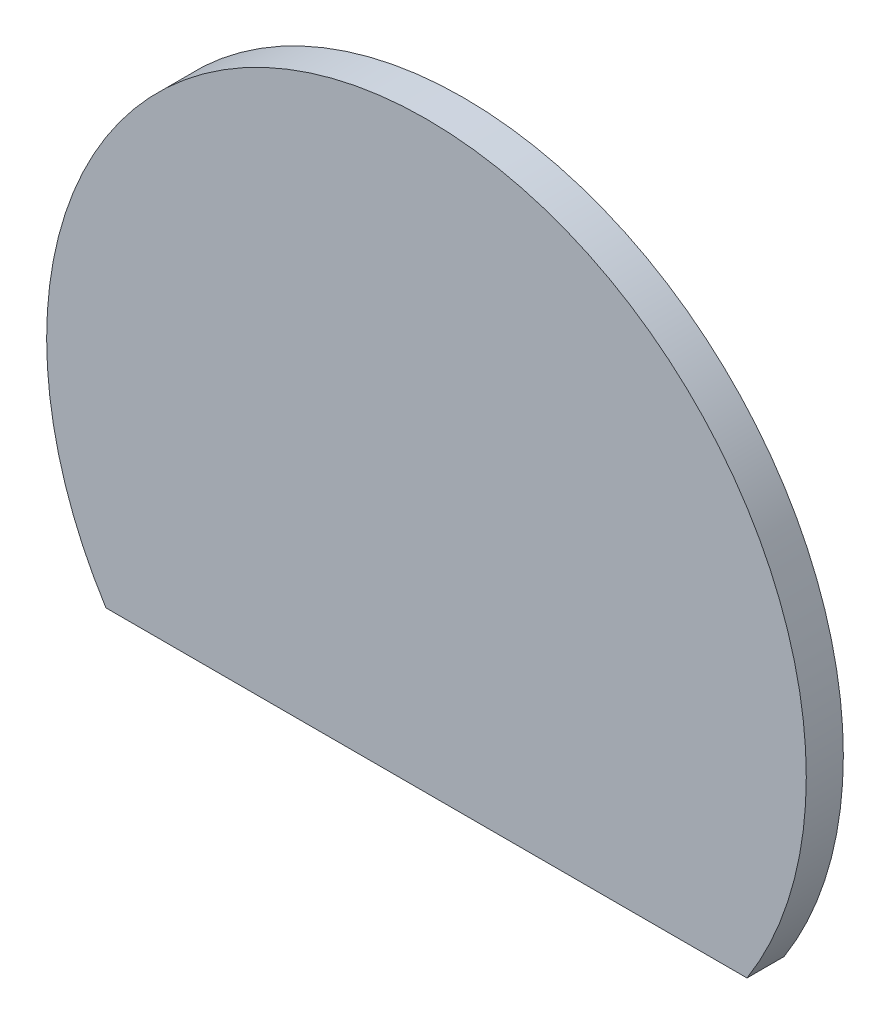
ISO-10303-21;
HEADER;
FILE_DESCRIPTION(('STEP AP214'),'2;1');
FILE_NAME('part.step','',(''),(''),'','','');
FILE_SCHEMA(('AUTOMOTIVE_DESIGN { 1 0 10303 214 1 1 1 1 }'));
ENDSEC;
DATA;
#1=APPLICATION_CONTEXT('core data for automotive mechanical design processes');
#2=APPLICATION_PROTOCOL_DEFINITION('international standard','automotive_design',2000,#1);
#3=PRODUCT_CONTEXT('',#1,'mechanical');
#4=PRODUCT('Part','Part','',(#3));
#5=PRODUCT_RELATED_PRODUCT_CATEGORY('part','',(#4));
#6=PRODUCT_DEFINITION_FORMATION('','',#4);
#7=PRODUCT_DEFINITION_CONTEXT('part definition',#1,'design');
#8=PRODUCT_DEFINITION('design','',#6,#7);
#9=PRODUCT_DEFINITION_SHAPE('','',#8);
#10=(LENGTH_UNIT() NAMED_UNIT(*) SI_UNIT(.MILLI.,.METRE.));
#11=(NAMED_UNIT(*) PLANE_ANGLE_UNIT() SI_UNIT($,.RADIAN.));
#12=(NAMED_UNIT(*) SI_UNIT($,.STERADIAN.) SOLID_ANGLE_UNIT());
#13=UNCERTAINTY_MEASURE_WITH_UNIT(LENGTH_MEASURE(1.E-05),#10,'distance_accuracy_value','');
#14=(GEOMETRIC_REPRESENTATION_CONTEXT(3) GLOBAL_UNCERTAINTY_ASSIGNED_CONTEXT((#13)) GLOBAL_UNIT_ASSIGNED_CONTEXT((#10,
#11,#12)) REPRESENTATION_CONTEXT('',''));
#15=CARTESIAN_POINT('',(0.,0.,0.));
#16=DIRECTION('',(0.,0.,1.));
#17=DIRECTION('',(1.,0.,0.));
#18=AXIS2_PLACEMENT_3D('',#15,#16,#17);
#19=CARTESIAN_POINT('',(0.,-5.5,1.));
#20=DIRECTION('',(0.,1.,0.));
#21=DIRECTION('',(0.,0.,1.));
#22=AXIS2_PLACEMENT_3D('',#19,#20,#21);
#23=PLANE('',#22);
#24=DIRECTION('',(1.,0.,0.));
#25=VECTOR('',#24,1.);
#26=CARTESIAN_POINT('',(0.,-5.5,0.));
#27=LINE('',#26,#25);
#28=CARTESIAN_POINT('',(-8.64942194600309,-5.5,0.));
#29=VERTEX_POINT('',#28);
#30=CARTESIAN_POINT('',(0.,-5.5,0.));
#31=VERTEX_POINT('',#30);
#32=EDGE_CURVE('E86',#29,#31,#27,.T.);
#33=ORIENTED_EDGE('',*,*,#32,.T.);
#34=CARTESIAN_POINT('',(8.64942194600309,-5.5,0.));
#35=VERTEX_POINT('',#34);
#36=EDGE_CURVE('E91',#31,#35,#27,.T.);
#37=ORIENTED_EDGE('',*,*,#36,.T.);
#38=DIRECTION('',(0.,0.,-1.));
#39=VECTOR('',#38,1.);
#40=CARTESIAN_POINT('',(8.64942194600309,-5.5,1.));
#41=LINE('',#40,#39);
#42=CARTESIAN_POINT('',(8.64942194600309,-5.5,1.));
#43=VERTEX_POINT('',#42);
#44=EDGE_CURVE('E48',#43,#35,#41,.T.);
#45=ORIENTED_EDGE('',*,*,#44,.F.);
#46=DIRECTION('',(1.,0.,0.));
#47=VECTOR('',#46,1.);
#48=CARTESIAN_POINT('',(0.,-5.5,1.));
#49=LINE('',#48,#47);
#50=CARTESIAN_POINT('',(-8.64942194600309,-5.5,1.));
#51=VERTEX_POINT('',#50);
#52=EDGE_CURVE('E85',#51,#43,#49,.T.);
#53=ORIENTED_EDGE('',*,*,#52,.F.);
#54=DIRECTION('',(0.,0.,-1.));
#55=VECTOR('',#54,1.);
#56=CARTESIAN_POINT('',(-8.64942194600309,-5.5,1.));
#57=LINE('',#56,#55);
#58=EDGE_CURVE('E79',#51,#29,#57,.T.);
#59=ORIENTED_EDGE('',*,*,#58,.T.);
#60=EDGE_LOOP('',(#33,#37,#45,#53,#59));
#61=FACE_BOUND('',#60,.T.);
#62=ADVANCED_FACE('F45',(#61),#23,.F.);
#63=CARTESIAN_POINT('',(0.,0.,1.));
#64=DIRECTION('',(0.,0.,-1.));
#65=DIRECTION('',(-1.,0.,0.));
#66=AXIS2_PLACEMENT_3D('',#63,#64,#65);
#67=CYLINDRICAL_SURFACE('',#66,10.25);
#68=CARTESIAN_POINT('',(0.,0.,0.));
#69=DIRECTION('',(0.,0.,1.));
#70=DIRECTION('',(1.,0.,0.));
#71=AXIS2_PLACEMENT_3D('',#68,#69,#70);
#72=CIRCLE('',#71,10.25);
#73=EDGE_CURVE('E76',#35,#29,#72,.T.);
#74=ORIENTED_EDGE('',*,*,#73,.T.);
#75=ORIENTED_EDGE('',*,*,#58,.F.);
#76=CARTESIAN_POINT('',(0.,0.,1.));
#77=DIRECTION('',(0.,0.,1.));
#78=DIRECTION('',(1.,0.,0.));
#79=AXIS2_PLACEMENT_3D('',#76,#77,#78);
#80=CIRCLE('',#79,10.25);
#81=EDGE_CURVE('E65',#43,#51,#80,.T.);
#82=ORIENTED_EDGE('',*,*,#81,.F.);
#83=ORIENTED_EDGE('',*,*,#44,.T.);
#84=EDGE_LOOP('',(#74,#75,#82,#83));
#85=FACE_BOUND('',#84,.T.);
#86=ADVANCED_FACE('F78',(#85),#67,.T.);
#87=CARTESIAN_POINT('',(0.,0.,1.));
#88=DIRECTION('',(0.,0.,1.));
#89=DIRECTION('',(1.,0.,0.));
#90=AXIS2_PLACEMENT_3D('',#87,#88,#89);
#91=PLANE('',#90);
#92=ORIENTED_EDGE('',*,*,#52,.T.);
#93=ORIENTED_EDGE('',*,*,#81,.T.);
#94=EDGE_LOOP('',(#92,#93));
#95=FACE_BOUND('',#94,.T.);
#96=ADVANCED_FACE('F121',(#95),#91,.T.);
#97=CARTESIAN_POINT('',(0.,0.,0.));
#98=DIRECTION('',(0.,0.,1.));
#99=DIRECTION('',(1.,0.,0.));
#100=AXIS2_PLACEMENT_3D('',#97,#98,#99);
#101=PLANE('',#100);
#102=ORIENTED_EDGE('',*,*,#36,.F.);
#103=CARTESIAN_POINT('',(0.,0.,0.));
#104=DIRECTION('',(0.,0.,1.));
#105=DIRECTION('',(1.,0.,0.));
#106=AXIS2_PLACEMENT_3D('',#103,#104,#105);
#107=CIRCLE('',#106,5.5);
#108=EDGE_CURVE('E58',#31,#31,#107,.T.);
#109=ORIENTED_EDGE('',*,*,#108,.T.);
#110=ORIENTED_EDGE('',*,*,#32,.F.);
#111=ORIENTED_EDGE('',*,*,#73,.F.);
#112=EDGE_LOOP('',(#102,#109,#110,#111));
#113=FACE_BOUND('',#112,.T.);
#114=ADVANCED_FACE('F90',(#113),#101,.F.);
#115=CARTESIAN_POINT('',(0.,0.,-2.));
#116=DIRECTION('',(0.,0.,1.));
#117=DIRECTION('',(1.,0.,0.));
#118=AXIS2_PLACEMENT_3D('',#115,#116,#117);
#119=CYLINDRICAL_SURFACE('',#118,5.5);
#120=CARTESIAN_POINT('',(0.,0.,-2.));
#121=DIRECTION('',(0.,0.,1.));
#122=DIRECTION('',(1.,0.,0.));
#123=AXIS2_PLACEMENT_3D('',#120,#121,#122);
#124=CIRCLE('',#123,5.5);
#125=CARTESIAN_POINT('',(5.5,0.,-2.));
#126=VERTEX_POINT('',#125);
#127=EDGE_CURVE('E93',#126,#126,#124,.T.);
#128=ORIENTED_EDGE('',*,*,#127,.T.);
#129=EDGE_LOOP('',(#128));
#130=FACE_BOUND('',#129,.T.);
#131=ORIENTED_EDGE('',*,*,#108,.F.);
#132=EDGE_LOOP('',(#131));
#133=FACE_BOUND('',#132,.T.);
#134=ADVANCED_FACE('F120',(#130,#133),#119,.T.);
#135=CARTESIAN_POINT('',(0.,0.,-2.));
#136=DIRECTION('',(0.,0.,1.));
#137=DIRECTION('',(1.,0.,0.));
#138=AXIS2_PLACEMENT_3D('',#135,#136,#137);
#139=PLANE('',#138);
#140=CARTESIAN_POINT('',(0.,0.,-2.));
#141=DIRECTION('',(0.,0.,1.));
#142=DIRECTION('',(1.,0.,0.));
#143=AXIS2_PLACEMENT_3D('',#140,#141,#142);
#144=CIRCLE('',#143,4.5);
#145=CARTESIAN_POINT('',(4.5,0.,-2.));
#146=VERTEX_POINT('',#145);
#147=EDGE_CURVE('E98',#146,#146,#144,.T.);
#148=ORIENTED_EDGE('',*,*,#147,.T.);
#149=EDGE_LOOP('',(#148));
#150=FACE_BOUND('',#149,.T.);
#151=ORIENTED_EDGE('',*,*,#127,.F.);
#152=EDGE_LOOP('',(#151));
#153=FACE_BOUND('',#152,.T.);
#154=ADVANCED_FACE('F104',(#150,#153),#139,.F.);
#155=CARTESIAN_POINT('',(0.,0.,-2.));
#156=DIRECTION('',(0.,0.,1.));
#157=DIRECTION('',(1.,0.,0.));
#158=AXIS2_PLACEMENT_3D('',#155,#156,#157);
#159=CYLINDRICAL_SURFACE('',#158,4.5);
#160=ORIENTED_EDGE('',*,*,#147,.F.);
#161=EDGE_LOOP('',(#160));
#162=FACE_BOUND('',#161,.T.);
#163=CARTESIAN_POINT('',(0.,0.,0.));
#164=DIRECTION('',(0.,0.,1.));
#165=DIRECTION('',(1.,0.,0.));
#166=AXIS2_PLACEMENT_3D('',#163,#164,#165);
#167=CIRCLE('',#166,4.5);
#168=CARTESIAN_POINT('',(4.5,0.,0.));
#169=VERTEX_POINT('',#168);
#170=EDGE_CURVE('E12',#169,#169,#167,.T.);
#171=ORIENTED_EDGE('',*,*,#170,.T.);
#172=EDGE_LOOP('',(#171));
#173=FACE_BOUND('',#172,.T.);
#174=ADVANCED_FACE('F107',(#162,#173),#159,.F.);
#175=ORIENTED_EDGE('',*,*,#170,.F.);
#176=EDGE_LOOP('',(#175));
#177=FACE_BOUND('',#176,.T.);
#178=ADVANCED_FACE('F110',(#177),#101,.F.);
#179=CLOSED_SHELL('',(#62,#86,#96,#114,#134,#154,#174,#178));
#180=MANIFOLD_SOLID_BREP('B2',#179);
#181=ADVANCED_BREP_SHAPE_REPRESENTATION('',(#18,#180),#14);
#182=SHAPE_DEFINITION_REPRESENTATION(#9,#181);
ENDSEC;
END-ISO-10303-21;
